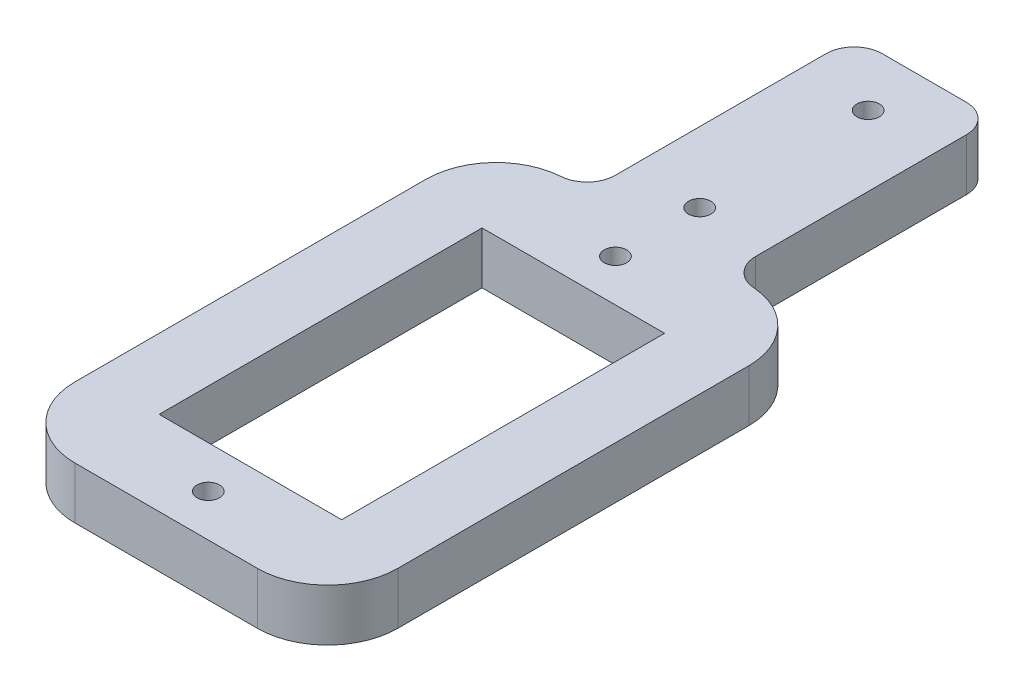
ISO-10303-21;
HEADER;
FILE_DESCRIPTION(('STEP AP214'),'2;1');
FILE_NAME('part.step','',(''),(''),'','','');
FILE_SCHEMA(('AUTOMOTIVE_DESIGN { 1 0 10303 214 1 1 1 1 }'));
ENDSEC;
DATA;
#1=APPLICATION_CONTEXT('core data for automotive mechanical design processes');
#2=APPLICATION_PROTOCOL_DEFINITION('international standard','automotive_design',2000,#1);
#3=PRODUCT_CONTEXT('',#1,'mechanical');
#4=PRODUCT('Part','Part','',(#3));
#5=PRODUCT_RELATED_PRODUCT_CATEGORY('part','',(#4));
#6=PRODUCT_DEFINITION_FORMATION('','',#4);
#7=PRODUCT_DEFINITION_CONTEXT('part definition',#1,'design');
#8=PRODUCT_DEFINITION('design','',#6,#7);
#9=PRODUCT_DEFINITION_SHAPE('','',#8);
#10=(LENGTH_UNIT() NAMED_UNIT(*) SI_UNIT(.MILLI.,.METRE.));
#11=(NAMED_UNIT(*) PLANE_ANGLE_UNIT() SI_UNIT($,.RADIAN.));
#12=(NAMED_UNIT(*) SI_UNIT($,.STERADIAN.) SOLID_ANGLE_UNIT());
#13=UNCERTAINTY_MEASURE_WITH_UNIT(LENGTH_MEASURE(1.E-05),#10,'distance_accuracy_value','');
#14=(GEOMETRIC_REPRESENTATION_CONTEXT(3) GLOBAL_UNCERTAINTY_ASSIGNED_CONTEXT((#13)) GLOBAL_UNIT_ASSIGNED_CONTEXT((#10,
#11,#12)) REPRESENTATION_CONTEXT('',''));
#15=CARTESIAN_POINT('',(0.,0.,0.));
#16=DIRECTION('',(0.,0.,1.));
#17=DIRECTION('',(1.,0.,0.));
#18=AXIS2_PLACEMENT_3D('',#15,#16,#17);
#19=CARTESIAN_POINT('',(11.5,-3.7,-17.5));
#20=DIRECTION('',(1.,0.,0.));
#21=DIRECTION('',(0.,0.,-1.));
#22=AXIS2_PLACEMENT_3D('',#19,#20,#21);
#23=PLANE('',#22);
#24=DIRECTION('',(0.,0.,-1.));
#25=VECTOR('',#24,1.);
#26=CARTESIAN_POINT('',(11.5,0.,-17.5));
#27=LINE('',#26,#25);
#28=CARTESIAN_POINT('',(11.5,0.,12.5));
#29=VERTEX_POINT('',#28);
#30=CARTESIAN_POINT('',(11.5,0.,-12.5));
#31=VERTEX_POINT('',#30);
#32=EDGE_CURVE('E204',#29,#31,#27,.T.);
#33=ORIENTED_EDGE('',*,*,#32,.F.);
#34=DIRECTION('',(0.,1.,0.));
#35=VECTOR('',#34,1.);
#36=CARTESIAN_POINT('',(11.5,-3.7,12.5));
#37=LINE('',#36,#35);
#38=CARTESIAN_POINT('',(11.5,-3.7,12.5));
#39=VERTEX_POINT('',#38);
#40=EDGE_CURVE('E242',#29,#39,#37,.F.);
#41=ORIENTED_EDGE('',*,*,#40,.T.);
#42=DIRECTION('',(0.,0.,-1.));
#43=VECTOR('',#42,1.);
#44=CARTESIAN_POINT('',(11.5,-3.7,-17.5));
#45=LINE('',#44,#43);
#46=CARTESIAN_POINT('',(11.5,-3.7,-12.5));
#47=VERTEX_POINT('',#46);
#48=EDGE_CURVE('E208',#39,#47,#45,.T.);
#49=ORIENTED_EDGE('',*,*,#48,.T.);
#50=DIRECTION('',(0.,1.,0.));
#51=VECTOR('',#50,1.);
#52=CARTESIAN_POINT('',(11.5,-3.7,-12.5));
#53=LINE('',#52,#51);
#54=EDGE_CURVE('E239',#47,#31,#53,.T.);
#55=ORIENTED_EDGE('',*,*,#54,.T.);
#56=EDGE_LOOP('',(#33,#41,#49,#55));
#57=FACE_BOUND('',#56,.T.);
#58=ADVANCED_FACE('F35',(#57),#23,.T.);
#59=CARTESIAN_POINT('',(11.5,-3.7,17.5));
#60=DIRECTION('',(0.,0.,1.));
#61=DIRECTION('',(1.,0.,0.));
#62=AXIS2_PLACEMENT_3D('',#59,#60,#61);
#63=PLANE('',#62);
#64=DIRECTION('',(1.,0.,0.));
#65=VECTOR('',#64,1.);
#66=CARTESIAN_POINT('',(11.5,-3.7,17.5));
#67=LINE('',#66,#65);
#68=CARTESIAN_POINT('',(-6.5,-3.7,17.5));
#69=VERTEX_POINT('',#68);
#70=CARTESIAN_POINT('',(6.5,-3.7,17.5));
#71=VERTEX_POINT('',#70);
#72=EDGE_CURVE('E215',#69,#71,#67,.T.);
#73=ORIENTED_EDGE('',*,*,#72,.T.);
#74=DIRECTION('',(0.,1.,0.));
#75=VECTOR('',#74,1.);
#76=CARTESIAN_POINT('',(6.5,-3.7,17.5));
#77=LINE('',#76,#75);
#78=CARTESIAN_POINT('',(6.5,0.,17.5));
#79=VERTEX_POINT('',#78);
#80=EDGE_CURVE('E227',#71,#79,#77,.T.);
#81=ORIENTED_EDGE('',*,*,#80,.T.);
#82=DIRECTION('',(1.,0.,0.));
#83=VECTOR('',#82,1.);
#84=CARTESIAN_POINT('',(11.5,0.,17.5));
#85=LINE('',#84,#83);
#86=CARTESIAN_POINT('',(-6.5,0.,17.5));
#87=VERTEX_POINT('',#86);
#88=EDGE_CURVE('E212',#87,#79,#85,.T.);
#89=ORIENTED_EDGE('',*,*,#88,.F.);
#90=DIRECTION('',(0.,1.,0.));
#91=VECTOR('',#90,1.);
#92=CARTESIAN_POINT('',(-6.5,-3.7,17.5));
#93=LINE('',#92,#91);
#94=EDGE_CURVE('E218',#87,#69,#93,.F.);
#95=ORIENTED_EDGE('',*,*,#94,.T.);
#96=EDGE_LOOP('',(#73,#81,#89,#95));
#97=FACE_BOUND('',#96,.T.);
#98=ADVANCED_FACE('F321',(#97),#63,.T.);
#99=CARTESIAN_POINT('',(-11.5,-3.7,17.5));
#100=DIRECTION('',(-1.,0.,0.));
#101=DIRECTION('',(0.,0.,1.));
#102=AXIS2_PLACEMENT_3D('',#99,#100,#101);
#103=PLANE('',#102);
#104=DIRECTION('',(0.,0.,1.));
#105=VECTOR('',#104,1.);
#106=CARTESIAN_POINT('',(-11.5,-3.7,17.5));
#107=LINE('',#106,#105);
#108=CARTESIAN_POINT('',(-11.5,-3.7,-12.5));
#109=VERTEX_POINT('',#108);
#110=CARTESIAN_POINT('',(-11.5,-3.7,12.5));
#111=VERTEX_POINT('',#110);
#112=EDGE_CURVE('E211',#109,#111,#107,.T.);
#113=ORIENTED_EDGE('',*,*,#112,.T.);
#114=DIRECTION('',(0.,1.,0.));
#115=VECTOR('',#114,1.);
#116=CARTESIAN_POINT('',(-11.5,-3.7,12.5));
#117=LINE('',#116,#115);
#118=CARTESIAN_POINT('',(-11.5,0.,12.5));
#119=VERTEX_POINT('',#118);
#120=EDGE_CURVE('E255',#111,#119,#117,.T.);
#121=ORIENTED_EDGE('',*,*,#120,.T.);
#122=DIRECTION('',(0.,0.,1.));
#123=VECTOR('',#122,1.);
#124=CARTESIAN_POINT('',(-11.5,0.,17.5));
#125=LINE('',#124,#123);
#126=CARTESIAN_POINT('',(-11.5,0.,-12.5));
#127=VERTEX_POINT('',#126);
#128=EDGE_CURVE('E221',#127,#119,#125,.T.);
#129=ORIENTED_EDGE('',*,*,#128,.F.);
#130=DIRECTION('',(0.,1.,0.));
#131=VECTOR('',#130,1.);
#132=CARTESIAN_POINT('',(-11.5,-3.7,-12.5));
#133=LINE('',#132,#131);
#134=EDGE_CURVE('E253',#127,#109,#133,.F.);
#135=ORIENTED_EDGE('',*,*,#134,.T.);
#136=EDGE_LOOP('',(#113,#121,#129,#135));
#137=FACE_BOUND('',#136,.T.);
#138=ADVANCED_FACE('F312',(#137),#103,.T.);
#139=CARTESIAN_POINT('',(0.,-3.7,0.));
#140=DIRECTION('',(0.,-1.,0.));
#141=DIRECTION('',(0.,0.,-1.));
#142=AXIS2_PLACEMENT_3D('',#139,#140,#141);
#143=PLANE('',#142);
#144=CARTESIAN_POINT('',(0.,-3.7,-32.5));
#145=DIRECTION('',(0.,1.,0.));
#146=DIRECTION('',(0.,0.,1.));
#147=AXIS2_PLACEMENT_3D('',#144,#145,#146);
#148=CIRCLE('',#147,0.800000000000001);
#149=CARTESIAN_POINT('',(0.,-3.7,-31.7));
#150=VERTEX_POINT('',#149);
#151=EDGE_CURVE('E418',#150,#150,#148,.T.);
#152=ORIENTED_EDGE('',*,*,#151,.T.);
#153=EDGE_LOOP('',(#152));
#154=FACE_BOUND('',#153,.T.);
#155=CARTESIAN_POINT('',(0.,-3.7,-20.5));
#156=DIRECTION('',(0.,1.,0.));
#157=DIRECTION('',(0.,0.,1.));
#158=AXIS2_PLACEMENT_3D('',#155,#156,#157);
#159=CIRCLE('',#158,0.799999999999998);
#160=CARTESIAN_POINT('',(0.,-3.7,-19.7));
#161=VERTEX_POINT('',#160);
#162=EDGE_CURVE('E427',#161,#161,#159,.T.);
#163=ORIENTED_EDGE('',*,*,#162,.T.);
#164=EDGE_LOOP('',(#163));
#165=FACE_BOUND('',#164,.T.);
#166=CARTESIAN_POINT('',(0.,-3.7,14.5));
#167=DIRECTION('',(0.,1.,0.));
#168=DIRECTION('',(0.,0.,1.));
#169=AXIS2_PLACEMENT_3D('',#166,#167,#168);
#170=CIRCLE('',#169,0.8);
#171=CARTESIAN_POINT('',(0.,-3.7,15.3));
#172=VERTEX_POINT('',#171);
#173=EDGE_CURVE('E352',#172,#172,#170,.T.);
#174=ORIENTED_EDGE('',*,*,#173,.T.);
#175=EDGE_LOOP('',(#174));
#176=FACE_BOUND('',#175,.T.);
#177=CARTESIAN_POINT('',(0.,-3.7,-14.5));
#178=DIRECTION('',(0.,1.,0.));
#179=DIRECTION('',(0.,0.,1.));
#180=AXIS2_PLACEMENT_3D('',#177,#178,#179);
#181=CIRCLE('',#180,0.8);
#182=CARTESIAN_POINT('',(0.,-3.7,-13.7));
#183=VERTEX_POINT('',#182);
#184=EDGE_CURVE('E198',#183,#183,#181,.T.);
#185=ORIENTED_EDGE('',*,*,#184,.T.);
#186=EDGE_LOOP('',(#185));
#187=FACE_BOUND('',#186,.T.);
#188=DIRECTION('',(-1.,0.,0.));
#189=VECTOR('',#188,1.);
#190=CARTESIAN_POINT('',(6.5,-3.7,-11.5));
#191=LINE('',#190,#189);
#192=CARTESIAN_POINT('',(6.5,-3.7,-11.5));
#193=VERTEX_POINT('',#192);
#194=CARTESIAN_POINT('',(-6.5,-3.7,-11.5));
#195=VERTEX_POINT('',#194);
#196=EDGE_CURVE('E165',#193,#195,#191,.T.);
#197=ORIENTED_EDGE('',*,*,#196,.T.);
#198=DIRECTION('',(0.,0.,1.));
#199=VECTOR('',#198,1.);
#200=CARTESIAN_POINT('',(-6.5,-3.7,-11.5));
#201=LINE('',#200,#199);
#202=CARTESIAN_POINT('',(-6.5,-3.7,11.5));
#203=VERTEX_POINT('',#202);
#204=EDGE_CURVE('E177',#195,#203,#201,.T.);
#205=ORIENTED_EDGE('',*,*,#204,.T.);
#206=DIRECTION('',(1.,0.,0.));
#207=VECTOR('',#206,1.);
#208=CARTESIAN_POINT('',(-6.5,-3.7,11.5));
#209=LINE('',#208,#207);
#210=CARTESIAN_POINT('',(6.5,-3.7,11.5));
#211=VERTEX_POINT('',#210);
#212=EDGE_CURVE('E181',#203,#211,#209,.T.);
#213=ORIENTED_EDGE('',*,*,#212,.T.);
#214=DIRECTION('',(0.,0.,-1.));
#215=VECTOR('',#214,1.);
#216=CARTESIAN_POINT('',(6.5,-3.7,11.5));
#217=LINE('',#216,#215);
#218=EDGE_CURVE('E173',#211,#193,#217,.T.);
#219=ORIENTED_EDGE('',*,*,#218,.T.);
#220=EDGE_LOOP('',(#197,#205,#213,#219));
#221=FACE_BOUND('',#220,.T.);
#222=DIRECTION('',(-1.,0.,0.));
#223=VECTOR('',#222,1.);
#224=CARTESIAN_POINT('',(5.,-3.7,-36.5));
#225=LINE('',#224,#223);
#226=CARTESIAN_POINT('',(3.,-3.7,-36.5));
#227=VERTEX_POINT('',#226);
#228=CARTESIAN_POINT('',(-3.,-3.7,-36.5));
#229=VERTEX_POINT('',#228);
#230=EDGE_CURVE('E351',#227,#229,#225,.T.);
#231=ORIENTED_EDGE('',*,*,#230,.F.);
#232=CARTESIAN_POINT('',(3.,-3.7,-34.5));
#233=DIRECTION('',(0.,-1.,0.));
#234=DIRECTION('',(0.,0.,-1.));
#235=AXIS2_PLACEMENT_3D('',#232,#233,#234);
#236=CIRCLE('',#235,2.);
#237=CARTESIAN_POINT('',(5.,-3.7,-34.5));
#238=VERTEX_POINT('',#237);
#239=EDGE_CURVE('E58',#227,#238,#236,.T.);
#240=ORIENTED_EDGE('',*,*,#239,.T.);
#241=DIRECTION('',(0.,0.,1.));
#242=VECTOR('',#241,1.);
#243=CARTESIAN_POINT('',(5.,-3.7,-36.5));
#244=LINE('',#243,#242);
#245=CARTESIAN_POINT('',(5.,-3.7,-19.4821200218845));
#246=VERTEX_POINT('',#245);
#247=EDGE_CURVE('E298',#238,#246,#244,.T.);
#248=ORIENTED_EDGE('',*,*,#247,.T.);
#249=CARTESIAN_POINT('',(7.,-3.7,-19.4821200218845));
#250=DIRECTION('',(0.,-1.,0.));
#251=DIRECTION('',(0.,0.,-1.));
#252=AXIS2_PLACEMENT_3D('',#249,#250,#251);
#253=CIRCLE('',#252,2.);
#254=CARTESIAN_POINT('',(6.85714285714286,-3.7,-17.4872285870603));
#255=VERTEX_POINT('',#254);
#256=EDGE_CURVE('E283',#246,#255,#253,.F.);
#257=ORIENTED_EDGE('',*,*,#256,.T.);
#258=CARTESIAN_POINT('',(6.5,-3.7,-12.5));
#259=DIRECTION('',(0.,-1.,0.));
#260=DIRECTION('',(0.,0.,-1.));
#261=AXIS2_PLACEMENT_3D('',#258,#259,#260);
#262=CIRCLE('',#261,5.);
#263=EDGE_CURVE('E247',#255,#47,#262,.T.);
#264=ORIENTED_EDGE('',*,*,#263,.T.);
#265=ORIENTED_EDGE('',*,*,#48,.F.);
#266=CARTESIAN_POINT('',(6.5,-3.7,12.5));
#267=DIRECTION('',(0.,-1.,0.));
#268=DIRECTION('',(0.,0.,-1.));
#269=AXIS2_PLACEMENT_3D('',#266,#267,#268);
#270=CIRCLE('',#269,5.);
#271=EDGE_CURVE('E251',#39,#71,#270,.T.);
#272=ORIENTED_EDGE('',*,*,#271,.T.);
#273=ORIENTED_EDGE('',*,*,#72,.F.);
#274=CARTESIAN_POINT('',(-6.5,-3.7,12.5));
#275=DIRECTION('',(0.,-1.,0.));
#276=DIRECTION('',(0.,0.,-1.));
#277=AXIS2_PLACEMENT_3D('',#274,#275,#276);
#278=CIRCLE('',#277,5.);
#279=EDGE_CURVE('E249',#69,#111,#278,.T.);
#280=ORIENTED_EDGE('',*,*,#279,.T.);
#281=ORIENTED_EDGE('',*,*,#112,.F.);
#282=CARTESIAN_POINT('',(-6.5,-3.7,-12.5));
#283=DIRECTION('',(0.,-1.,0.));
#284=DIRECTION('',(0.,0.,-1.));
#285=AXIS2_PLACEMENT_3D('',#282,#283,#284);
#286=CIRCLE('',#285,5.);
#287=CARTESIAN_POINT('',(-6.85714285714286,-3.7,-17.4872285870603));
#288=VERTEX_POINT('',#287);
#289=EDGE_CURVE('E244',#109,#288,#286,.T.);
#290=ORIENTED_EDGE('',*,*,#289,.T.);
#291=CARTESIAN_POINT('',(-7.,-3.7,-19.4821200218845));
#292=DIRECTION('',(0.,-1.,0.));
#293=DIRECTION('',(0.,0.,-1.));
#294=AXIS2_PLACEMENT_3D('',#291,#292,#293);
#295=CIRCLE('',#294,2.);
#296=CARTESIAN_POINT('',(-5.,-3.7,-19.4821200218845));
#297=VERTEX_POINT('',#296);
#298=EDGE_CURVE('E43',#288,#297,#295,.F.);
#299=ORIENTED_EDGE('',*,*,#298,.T.);
#300=DIRECTION('',(0.,0.,1.));
#301=VECTOR('',#300,1.);
#302=CARTESIAN_POINT('',(-5.,-3.7,-36.5));
#303=LINE('',#302,#301);
#304=CARTESIAN_POINT('',(-5.,-3.7,-34.5));
#305=VERTEX_POINT('',#304);
#306=EDGE_CURVE('E287',#305,#297,#303,.T.);
#307=ORIENTED_EDGE('',*,*,#306,.F.);
#308=CARTESIAN_POINT('',(-3.,-3.7,-34.5));
#309=DIRECTION('',(0.,-1.,0.));
#310=DIRECTION('',(0.,0.,-1.));
#311=AXIS2_PLACEMENT_3D('',#308,#309,#310);
#312=CIRCLE('',#311,2.);
#313=EDGE_CURVE('E50',#305,#229,#312,.T.);
#314=ORIENTED_EDGE('',*,*,#313,.T.);
#315=EDGE_LOOP('',(#231,#240,#248,#257,#264,#265,#272,#273,#280,#281,#290,#299,#307,#314));
#316=FACE_BOUND('',#315,.T.);
#317=ADVANCED_FACE('F183',(#154,#165,#176,#187,#221,#316),#143,.T.);
#318=CARTESIAN_POINT('',(0.,0.,0.));
#319=DIRECTION('',(0.,-1.,0.));
#320=DIRECTION('',(0.,0.,-1.));
#321=AXIS2_PLACEMENT_3D('',#318,#319,#320);
#322=PLANE('',#321);
#323=CARTESIAN_POINT('',(0.,0.,-32.5));
#324=DIRECTION('',(0.,1.,0.));
#325=DIRECTION('',(0.,0.,1.));
#326=AXIS2_PLACEMENT_3D('',#323,#324,#325);
#327=CIRCLE('',#326,0.800000000000001);
#328=CARTESIAN_POINT('',(0.,0.,-31.7));
#329=VERTEX_POINT('',#328);
#330=EDGE_CURVE('E421',#329,#329,#327,.T.);
#331=ORIENTED_EDGE('',*,*,#330,.F.);
#332=EDGE_LOOP('',(#331));
#333=FACE_BOUND('',#332,.T.);
#334=CARTESIAN_POINT('',(0.,0.,-20.5));
#335=DIRECTION('',(0.,1.,0.));
#336=DIRECTION('',(0.,0.,1.));
#337=AXIS2_PLACEMENT_3D('',#334,#335,#336);
#338=CIRCLE('',#337,0.799999999999998);
#339=CARTESIAN_POINT('',(0.,0.,-19.7));
#340=VERTEX_POINT('',#339);
#341=EDGE_CURVE('E424',#340,#340,#338,.T.);
#342=ORIENTED_EDGE('',*,*,#341,.F.);
#343=EDGE_LOOP('',(#342));
#344=FACE_BOUND('',#343,.T.);
#345=CARTESIAN_POINT('',(0.,0.,14.5));
#346=DIRECTION('',(0.,1.,0.));
#347=DIRECTION('',(0.,0.,1.));
#348=AXIS2_PLACEMENT_3D('',#345,#346,#347);
#349=CIRCLE('',#348,0.8);
#350=CARTESIAN_POINT('',(0.,0.,15.3));
#351=VERTEX_POINT('',#350);
#352=EDGE_CURVE('E346',#351,#351,#349,.T.);
#353=ORIENTED_EDGE('',*,*,#352,.F.);
#354=EDGE_LOOP('',(#353));
#355=FACE_BOUND('',#354,.T.);
#356=CARTESIAN_POINT('',(0.,0.,-14.5));
#357=DIRECTION('',(0.,1.,0.));
#358=DIRECTION('',(0.,0.,1.));
#359=AXIS2_PLACEMENT_3D('',#356,#357,#358);
#360=CIRCLE('',#359,0.8);
#361=CARTESIAN_POINT('',(0.,0.,-13.7));
#362=VERTEX_POINT('',#361);
#363=EDGE_CURVE('E191',#362,#362,#360,.T.);
#364=ORIENTED_EDGE('',*,*,#363,.F.);
#365=EDGE_LOOP('',(#364));
#366=FACE_BOUND('',#365,.T.);
#367=DIRECTION('',(0.,0.,1.));
#368=VECTOR('',#367,1.);
#369=CARTESIAN_POINT('',(-6.5,0.,-11.5));
#370=LINE('',#369,#368);
#371=CARTESIAN_POINT('',(-6.5,0.,-11.5));
#372=VERTEX_POINT('',#371);
#373=CARTESIAN_POINT('',(-6.5,0.,11.5));
#374=VERTEX_POINT('',#373);
#375=EDGE_CURVE('E197',#372,#374,#370,.T.);
#376=ORIENTED_EDGE('',*,*,#375,.F.);
#377=DIRECTION('',(-1.,0.,0.));
#378=VECTOR('',#377,1.);
#379=CARTESIAN_POINT('',(6.5,0.,-11.5));
#380=LINE('',#379,#378);
#381=CARTESIAN_POINT('',(6.5,0.,-11.5));
#382=VERTEX_POINT('',#381);
#383=EDGE_CURVE('E168',#382,#372,#380,.T.);
#384=ORIENTED_EDGE('',*,*,#383,.F.);
#385=DIRECTION('',(0.,0.,-1.));
#386=VECTOR('',#385,1.);
#387=CARTESIAN_POINT('',(6.5,0.,11.5));
#388=LINE('',#387,#386);
#389=CARTESIAN_POINT('',(6.5,0.,11.5));
#390=VERTEX_POINT('',#389);
#391=EDGE_CURVE('E185',#390,#382,#388,.T.);
#392=ORIENTED_EDGE('',*,*,#391,.F.);
#393=DIRECTION('',(1.,0.,0.));
#394=VECTOR('',#393,1.);
#395=CARTESIAN_POINT('',(-6.5,0.,11.5));
#396=LINE('',#395,#394);
#397=EDGE_CURVE('E188',#374,#390,#396,.T.);
#398=ORIENTED_EDGE('',*,*,#397,.F.);
#399=EDGE_LOOP('',(#376,#384,#392,#398));
#400=FACE_BOUND('',#399,.T.);
#401=DIRECTION('',(0.,0.,1.));
#402=VECTOR('',#401,1.);
#403=CARTESIAN_POINT('',(5.,0.,-36.5));
#404=LINE('',#403,#402);
#405=CARTESIAN_POINT('',(5.,0.,-34.5));
#406=VERTEX_POINT('',#405);
#407=CARTESIAN_POINT('',(5.,0.,-19.4821200218845));
#408=VERTEX_POINT('',#407);
#409=EDGE_CURVE('E344',#406,#408,#404,.T.);
#410=ORIENTED_EDGE('',*,*,#409,.F.);
#411=CARTESIAN_POINT('',(3.,0.,-34.5));
#412=DIRECTION('',(0.,-1.,0.));
#413=DIRECTION('',(0.,0.,-1.));
#414=AXIS2_PLACEMENT_3D('',#411,#412,#413);
#415=CIRCLE('',#414,2.);
#416=CARTESIAN_POINT('',(3.,0.,-36.5));
#417=VERTEX_POINT('',#416);
#418=EDGE_CURVE('E281',#406,#417,#415,.F.);
#419=ORIENTED_EDGE('',*,*,#418,.T.);
#420=DIRECTION('',(-1.,0.,0.));
#421=VECTOR('',#420,1.);
#422=CARTESIAN_POINT('',(5.,0.,-36.5));
#423=LINE('',#422,#421);
#424=CARTESIAN_POINT('',(-3.,0.,-36.5));
#425=VERTEX_POINT('',#424);
#426=EDGE_CURVE('E413',#417,#425,#423,.T.);
#427=ORIENTED_EDGE('',*,*,#426,.T.);
#428=CARTESIAN_POINT('',(-3.,0.,-34.5));
#429=DIRECTION('',(0.,-1.,0.));
#430=DIRECTION('',(0.,0.,-1.));
#431=AXIS2_PLACEMENT_3D('',#428,#429,#430);
#432=CIRCLE('',#431,2.);
#433=CARTESIAN_POINT('',(-5.,0.,-34.5));
#434=VERTEX_POINT('',#433);
#435=EDGE_CURVE('E279',#425,#434,#432,.F.);
#436=ORIENTED_EDGE('',*,*,#435,.T.);
#437=DIRECTION('',(0.,0.,1.));
#438=VECTOR('',#437,1.);
#439=CARTESIAN_POINT('',(-5.,0.,-36.5));
#440=LINE('',#439,#438);
#441=CARTESIAN_POINT('',(-5.,0.,-19.4821200218845));
#442=VERTEX_POINT('',#441);
#443=EDGE_CURVE('E299',#434,#442,#440,.T.);
#444=ORIENTED_EDGE('',*,*,#443,.T.);
#445=CARTESIAN_POINT('',(-7.,0.,-19.4821200218845));
#446=DIRECTION('',(0.,-1.,0.));
#447=DIRECTION('',(0.,0.,-1.));
#448=AXIS2_PLACEMENT_3D('',#445,#446,#447);
#449=CIRCLE('',#448,2.);
#450=CARTESIAN_POINT('',(-6.85714285714286,0.,-17.4872285870603));
#451=VERTEX_POINT('',#450);
#452=EDGE_CURVE('E11',#442,#451,#449,.T.);
#453=ORIENTED_EDGE('',*,*,#452,.T.);
#454=CARTESIAN_POINT('',(-6.5,0.,-12.5));
#455=DIRECTION('',(0.,-1.,0.));
#456=DIRECTION('',(0.,0.,-1.));
#457=AXIS2_PLACEMENT_3D('',#454,#455,#456);
#458=CIRCLE('',#457,5.);
#459=EDGE_CURVE('E230',#451,#127,#458,.F.);
#460=ORIENTED_EDGE('',*,*,#459,.T.);
#461=ORIENTED_EDGE('',*,*,#128,.T.);
#462=CARTESIAN_POINT('',(-6.5,0.,12.5));
#463=DIRECTION('',(0.,-1.,0.));
#464=DIRECTION('',(0.,0.,-1.));
#465=AXIS2_PLACEMENT_3D('',#462,#463,#464);
#466=CIRCLE('',#465,5.);
#467=EDGE_CURVE('E235',#119,#87,#466,.F.);
#468=ORIENTED_EDGE('',*,*,#467,.T.);
#469=ORIENTED_EDGE('',*,*,#88,.T.);
#470=CARTESIAN_POINT('',(6.5,0.,12.5));
#471=DIRECTION('',(0.,-1.,0.));
#472=DIRECTION('',(0.,0.,-1.));
#473=AXIS2_PLACEMENT_3D('',#470,#471,#472);
#474=CIRCLE('',#473,5.);
#475=EDGE_CURVE('E237',#79,#29,#474,.F.);
#476=ORIENTED_EDGE('',*,*,#475,.T.);
#477=ORIENTED_EDGE('',*,*,#32,.T.);
#478=CARTESIAN_POINT('',(6.5,0.,-12.5));
#479=DIRECTION('',(0.,-1.,0.));
#480=DIRECTION('',(0.,0.,-1.));
#481=AXIS2_PLACEMENT_3D('',#478,#479,#480);
#482=CIRCLE('',#481,5.);
#483=CARTESIAN_POINT('',(6.85714285714286,0.,-17.4872285870603));
#484=VERTEX_POINT('',#483);
#485=EDGE_CURVE('E232',#31,#484,#482,.F.);
#486=ORIENTED_EDGE('',*,*,#485,.T.);
#487=CARTESIAN_POINT('',(7.,0.,-19.4821200218845));
#488=DIRECTION('',(0.,-1.,0.));
#489=DIRECTION('',(0.,0.,-1.));
#490=AXIS2_PLACEMENT_3D('',#487,#488,#489);
#491=CIRCLE('',#490,2.);
#492=EDGE_CURVE('E285',#484,#408,#491,.T.);
#493=ORIENTED_EDGE('',*,*,#492,.T.);
#494=EDGE_LOOP('',(#410,#419,#427,#436,#444,#453,#460,#461,#468,#469,#476,#477,#486,#493));
#495=FACE_BOUND('',#494,.T.);
#496=ADVANCED_FACE('F306',(#333,#344,#355,#366,#400,#495),#322,.F.);
#497=CARTESIAN_POINT('',(6.5,-3.7,-11.5));
#498=DIRECTION('',(0.,0.,-1.));
#499=DIRECTION('',(-1.,0.,0.));
#500=AXIS2_PLACEMENT_3D('',#497,#498,#499);
#501=PLANE('',#500);
#502=ORIENTED_EDGE('',*,*,#383,.T.);
#503=DIRECTION('',(0.,1.,0.));
#504=VECTOR('',#503,1.);
#505=CARTESIAN_POINT('',(-6.5,-3.7,-11.5));
#506=LINE('',#505,#504);
#507=EDGE_CURVE('E161',#195,#372,#506,.T.);
#508=ORIENTED_EDGE('',*,*,#507,.F.);
#509=ORIENTED_EDGE('',*,*,#196,.F.);
#510=DIRECTION('',(0.,1.,0.));
#511=VECTOR('',#510,1.);
#512=CARTESIAN_POINT('',(6.5,-3.7,-11.5));
#513=LINE('',#512,#511);
#514=EDGE_CURVE('E202',#193,#382,#513,.T.);
#515=ORIENTED_EDGE('',*,*,#514,.T.);
#516=EDGE_LOOP('',(#502,#508,#509,#515));
#517=FACE_BOUND('',#516,.T.);
#518=ADVANCED_FACE('F163',(#517),#501,.F.);
#519=CARTESIAN_POINT('',(6.5,-3.7,11.5));
#520=DIRECTION('',(1.,0.,0.));
#521=DIRECTION('',(0.,0.,-1.));
#522=AXIS2_PLACEMENT_3D('',#519,#520,#521);
#523=PLANE('',#522);
#524=ORIENTED_EDGE('',*,*,#391,.T.);
#525=ORIENTED_EDGE('',*,*,#514,.F.);
#526=ORIENTED_EDGE('',*,*,#218,.F.);
#527=DIRECTION('',(0.,1.,0.));
#528=VECTOR('',#527,1.);
#529=CARTESIAN_POINT('',(6.5,-3.7,11.5));
#530=LINE('',#529,#528);
#531=EDGE_CURVE('E205',#211,#390,#530,.T.);
#532=ORIENTED_EDGE('',*,*,#531,.T.);
#533=EDGE_LOOP('',(#524,#525,#526,#532));
#534=FACE_BOUND('',#533,.T.);
#535=ADVANCED_FACE('F373',(#534),#523,.F.);
#536=CARTESIAN_POINT('',(-6.5,-3.7,11.5));
#537=DIRECTION('',(0.,0.,1.));
#538=DIRECTION('',(1.,0.,0.));
#539=AXIS2_PLACEMENT_3D('',#536,#537,#538);
#540=PLANE('',#539);
#541=ORIENTED_EDGE('',*,*,#397,.T.);
#542=ORIENTED_EDGE('',*,*,#531,.F.);
#543=ORIENTED_EDGE('',*,*,#212,.F.);
#544=DIRECTION('',(0.,1.,0.));
#545=VECTOR('',#544,1.);
#546=CARTESIAN_POINT('',(-6.5,-3.7,11.5));
#547=LINE('',#546,#545);
#548=EDGE_CURVE('E172',#203,#374,#547,.T.);
#549=ORIENTED_EDGE('',*,*,#548,.T.);
#550=EDGE_LOOP('',(#541,#542,#543,#549));
#551=FACE_BOUND('',#550,.T.);
#552=ADVANCED_FACE('F371',(#551),#540,.F.);
#553=CARTESIAN_POINT('',(-6.5,-3.7,-11.5));
#554=DIRECTION('',(-1.,0.,0.));
#555=DIRECTION('',(0.,0.,1.));
#556=AXIS2_PLACEMENT_3D('',#553,#554,#555);
#557=PLANE('',#556);
#558=ORIENTED_EDGE('',*,*,#375,.T.);
#559=ORIENTED_EDGE('',*,*,#548,.F.);
#560=ORIENTED_EDGE('',*,*,#204,.F.);
#561=ORIENTED_EDGE('',*,*,#507,.T.);
#562=EDGE_LOOP('',(#558,#559,#560,#561));
#563=FACE_BOUND('',#562,.T.);
#564=ADVANCED_FACE('F178',(#563),#557,.F.);
#565=CARTESIAN_POINT('',(0.,-3.7,-14.5));
#566=DIRECTION('',(0.,1.,0.));
#567=DIRECTION('',(0.,0.,1.));
#568=AXIS2_PLACEMENT_3D('',#565,#566,#567);
#569=CYLINDRICAL_SURFACE('',#568,0.8);
#570=ORIENTED_EDGE('',*,*,#184,.F.);
#571=EDGE_LOOP('',(#570));
#572=FACE_BOUND('',#571,.T.);
#573=ORIENTED_EDGE('',*,*,#363,.T.);
#574=EDGE_LOOP('',(#573));
#575=FACE_BOUND('',#574,.T.);
#576=ADVANCED_FACE('F362',(#572,#575),#569,.F.);
#577=CARTESIAN_POINT('',(0.,-3.7,14.5));
#578=DIRECTION('',(0.,1.,0.));
#579=DIRECTION('',(0.,0.,1.));
#580=AXIS2_PLACEMENT_3D('',#577,#578,#579);
#581=CYLINDRICAL_SURFACE('',#580,0.8);
#582=ORIENTED_EDGE('',*,*,#173,.F.);
#583=EDGE_LOOP('',(#582));
#584=FACE_BOUND('',#583,.T.);
#585=ORIENTED_EDGE('',*,*,#352,.T.);
#586=EDGE_LOOP('',(#585));
#587=FACE_BOUND('',#586,.T.);
#588=ADVANCED_FACE('F438',(#584,#587),#581,.F.);
#589=CARTESIAN_POINT('',(5.,0.,-36.5));
#590=DIRECTION('',(-1.,0.,0.));
#591=DIRECTION('',(0.,0.,1.));
#592=AXIS2_PLACEMENT_3D('',#589,#590,#591);
#593=PLANE('',#592);
#594=ORIENTED_EDGE('',*,*,#409,.T.);
#595=DIRECTION('',(0.,1.,0.));
#596=VECTOR('',#595,1.);
#597=CARTESIAN_POINT('',(5.,0.,-19.4821200218845));
#598=LINE('',#597,#596);
#599=EDGE_CURVE('E260',#408,#246,#598,.F.);
#600=ORIENTED_EDGE('',*,*,#599,.T.);
#601=ORIENTED_EDGE('',*,*,#247,.F.);
#602=DIRECTION('',(0.,-1.,0.));
#603=VECTOR('',#602,1.);
#604=CARTESIAN_POINT('',(5.,0.,-34.5));
#605=LINE('',#604,#603);
#606=EDGE_CURVE('E258',#238,#406,#605,.F.);
#607=ORIENTED_EDGE('',*,*,#606,.T.);
#608=EDGE_LOOP('',(#594,#600,#601,#607));
#609=FACE_BOUND('',#608,.T.);
#610=ADVANCED_FACE('F343',(#609),#593,.F.);
#611=CARTESIAN_POINT('',(-5.,0.,-36.5));
#612=DIRECTION('',(-1.,0.,0.));
#613=DIRECTION('',(0.,0.,1.));
#614=AXIS2_PLACEMENT_3D('',#611,#612,#613);
#615=PLANE('',#614);
#616=ORIENTED_EDGE('',*,*,#306,.T.);
#617=DIRECTION('',(0.,-1.,0.));
#618=VECTOR('',#617,1.);
#619=CARTESIAN_POINT('',(-5.,0.,-19.4821200218845));
#620=LINE('',#619,#618);
#621=EDGE_CURVE('E271',#297,#442,#620,.F.);
#622=ORIENTED_EDGE('',*,*,#621,.T.);
#623=ORIENTED_EDGE('',*,*,#443,.F.);
#624=DIRECTION('',(0.,-1.,0.));
#625=VECTOR('',#624,1.);
#626=CARTESIAN_POINT('',(-5.,-3.7,-34.5));
#627=LINE('',#626,#625);
#628=EDGE_CURVE('E268',#434,#305,#627,.T.);
#629=ORIENTED_EDGE('',*,*,#628,.T.);
#630=EDGE_LOOP('',(#616,#622,#623,#629));
#631=FACE_BOUND('',#630,.T.);
#632=ADVANCED_FACE('F294',(#631),#615,.T.);
#633=CARTESIAN_POINT('',(0.,0.,-36.5));
#634=DIRECTION('',(0.,0.,1.));
#635=DIRECTION('',(1.,0.,0.));
#636=AXIS2_PLACEMENT_3D('',#633,#634,#635);
#637=PLANE('',#636);
#638=ORIENTED_EDGE('',*,*,#426,.F.);
#639=DIRECTION('',(0.,-1.,0.));
#640=VECTOR('',#639,1.);
#641=CARTESIAN_POINT('',(3.,0.,-36.5));
#642=LINE('',#641,#640);
#643=EDGE_CURVE('E275',#417,#227,#642,.T.);
#644=ORIENTED_EDGE('',*,*,#643,.T.);
#645=ORIENTED_EDGE('',*,*,#230,.T.);
#646=DIRECTION('',(0.,-1.,0.));
#647=VECTOR('',#646,1.);
#648=CARTESIAN_POINT('',(-3.,0.,-36.5));
#649=LINE('',#648,#647);
#650=EDGE_CURVE('E273',#229,#425,#649,.F.);
#651=ORIENTED_EDGE('',*,*,#650,.T.);
#652=EDGE_LOOP('',(#638,#644,#645,#651));
#653=FACE_BOUND('',#652,.T.);
#654=ADVANCED_FACE('F416',(#653),#637,.F.);
#655=CARTESIAN_POINT('',(0.,-3.7,-20.5));
#656=DIRECTION('',(0.,1.,0.));
#657=DIRECTION('',(0.,0.,1.));
#658=AXIS2_PLACEMENT_3D('',#655,#656,#657);
#659=CYLINDRICAL_SURFACE('',#658,0.799999999999998);
#660=ORIENTED_EDGE('',*,*,#162,.F.);
#661=EDGE_LOOP('',(#660));
#662=FACE_BOUND('',#661,.T.);
#663=ORIENTED_EDGE('',*,*,#341,.T.);
#664=EDGE_LOOP('',(#663));
#665=FACE_BOUND('',#664,.T.);
#666=ADVANCED_FACE('F455',(#662,#665),#659,.F.);
#667=CARTESIAN_POINT('',(0.,-3.7,-32.5));
#668=DIRECTION('',(0.,1.,0.));
#669=DIRECTION('',(0.,0.,1.));
#670=AXIS2_PLACEMENT_3D('',#667,#668,#669);
#671=CYLINDRICAL_SURFACE('',#670,0.800000000000001);
#672=ORIENTED_EDGE('',*,*,#151,.F.);
#673=EDGE_LOOP('',(#672));
#674=FACE_BOUND('',#673,.T.);
#675=ORIENTED_EDGE('',*,*,#330,.T.);
#676=EDGE_LOOP('',(#675));
#677=FACE_BOUND('',#676,.T.);
#678=ADVANCED_FACE('F394',(#674,#677),#671,.F.);
#679=CARTESIAN_POINT('',(6.5,-3.7,12.5));
#680=DIRECTION('',(0.,1.,0.));
#681=DIRECTION('',(0.,0.,1.));
#682=AXIS2_PLACEMENT_3D('',#679,#680,#681);
#683=CYLINDRICAL_SURFACE('',#682,5.);
#684=ORIENTED_EDGE('',*,*,#271,.F.);
#685=ORIENTED_EDGE('',*,*,#40,.F.);
#686=ORIENTED_EDGE('',*,*,#475,.F.);
#687=ORIENTED_EDGE('',*,*,#80,.F.);
#688=EDGE_LOOP('',(#684,#685,#686,#687));
#689=FACE_BOUND('',#688,.T.);
#690=ADVANCED_FACE('F325',(#689),#683,.T.);
#691=CARTESIAN_POINT('',(-6.5,-3.7,12.5));
#692=DIRECTION('',(0.,1.,0.));
#693=DIRECTION('',(0.,0.,1.));
#694=AXIS2_PLACEMENT_3D('',#691,#692,#693);
#695=CYLINDRICAL_SURFACE('',#694,5.);
#696=ORIENTED_EDGE('',*,*,#279,.F.);
#697=ORIENTED_EDGE('',*,*,#94,.F.);
#698=ORIENTED_EDGE('',*,*,#467,.F.);
#699=ORIENTED_EDGE('',*,*,#120,.F.);
#700=EDGE_LOOP('',(#696,#697,#698,#699));
#701=FACE_BOUND('',#700,.T.);
#702=ADVANCED_FACE('F318',(#701),#695,.T.);
#703=CARTESIAN_POINT('',(6.5,-3.7,-12.5));
#704=DIRECTION('',(0.,1.,0.));
#705=DIRECTION('',(0.,0.,1.));
#706=AXIS2_PLACEMENT_3D('',#703,#704,#705);
#707=CYLINDRICAL_SURFACE('',#706,5.);
#708=ORIENTED_EDGE('',*,*,#263,.F.);
#709=DIRECTION('',(0.,1.,0.));
#710=VECTOR('',#709,1.);
#711=CARTESIAN_POINT('',(6.85714285714286,-3.7,-17.4872285870603));
#712=LINE('',#711,#710);
#713=EDGE_CURVE('E263',#255,#484,#712,.T.);
#714=ORIENTED_EDGE('',*,*,#713,.T.);
#715=ORIENTED_EDGE('',*,*,#485,.F.);
#716=ORIENTED_EDGE('',*,*,#54,.F.);
#717=EDGE_LOOP('',(#708,#714,#715,#716));
#718=FACE_BOUND('',#717,.T.);
#719=ADVANCED_FACE('F333',(#718),#707,.T.);
#720=CARTESIAN_POINT('',(-6.5,-3.7,-12.5));
#721=DIRECTION('',(0.,1.,0.));
#722=DIRECTION('',(0.,0.,1.));
#723=AXIS2_PLACEMENT_3D('',#720,#721,#722);
#724=CYLINDRICAL_SURFACE('',#723,5.);
#725=ORIENTED_EDGE('',*,*,#459,.F.);
#726=DIRECTION('',(0.,1.,0.));
#727=VECTOR('',#726,1.);
#728=CARTESIAN_POINT('',(-6.85714285714286,-3.7,-17.4872285870603));
#729=LINE('',#728,#727);
#730=EDGE_CURVE('E265',#451,#288,#729,.F.);
#731=ORIENTED_EDGE('',*,*,#730,.T.);
#732=ORIENTED_EDGE('',*,*,#289,.F.);
#733=ORIENTED_EDGE('',*,*,#134,.F.);
#734=EDGE_LOOP('',(#725,#731,#732,#733));
#735=FACE_BOUND('',#734,.T.);
#736=ADVANCED_FACE('F310',(#735),#724,.T.);
#737=CARTESIAN_POINT('',(7.,-3.7,-19.4821200218845));
#738=DIRECTION('',(0.,1.,0.));
#739=DIRECTION('',(0.,0.,1.));
#740=AXIS2_PLACEMENT_3D('',#737,#738,#739);
#741=CYLINDRICAL_SURFACE('',#740,2.);
#742=ORIENTED_EDGE('',*,*,#492,.F.);
#743=ORIENTED_EDGE('',*,*,#713,.F.);
#744=ORIENTED_EDGE('',*,*,#256,.F.);
#745=ORIENTED_EDGE('',*,*,#599,.F.);
#746=EDGE_LOOP('',(#742,#743,#744,#745));
#747=FACE_BOUND('',#746,.T.);
#748=ADVANCED_FACE('F339',(#747),#741,.F.);
#749=CARTESIAN_POINT('',(-7.,-3.7,-19.4821200218845));
#750=DIRECTION('',(0.,1.,0.));
#751=DIRECTION('',(0.,0.,1.));
#752=AXIS2_PLACEMENT_3D('',#749,#750,#751);
#753=CYLINDRICAL_SURFACE('',#752,2.);
#754=ORIENTED_EDGE('',*,*,#452,.F.);
#755=ORIENTED_EDGE('',*,*,#621,.F.);
#756=ORIENTED_EDGE('',*,*,#298,.F.);
#757=ORIENTED_EDGE('',*,*,#730,.F.);
#758=EDGE_LOOP('',(#754,#755,#756,#757));
#759=FACE_BOUND('',#758,.T.);
#760=ADVANCED_FACE('F302',(#759),#753,.F.);
#761=CARTESIAN_POINT('',(3.,0.,-34.5));
#762=DIRECTION('',(0.,-1.,0.));
#763=DIRECTION('',(0.,0.,-1.));
#764=AXIS2_PLACEMENT_3D('',#761,#762,#763);
#765=CYLINDRICAL_SURFACE('',#764,2.);
#766=ORIENTED_EDGE('',*,*,#418,.F.);
#767=ORIENTED_EDGE('',*,*,#606,.F.);
#768=ORIENTED_EDGE('',*,*,#239,.F.);
#769=ORIENTED_EDGE('',*,*,#643,.F.);
#770=EDGE_LOOP('',(#766,#767,#768,#769));
#771=FACE_BOUND('',#770,.T.);
#772=ADVANCED_FACE('F404',(#771),#765,.T.);
#773=CARTESIAN_POINT('',(-3.,0.,-34.5));
#774=DIRECTION('',(0.,1.,0.));
#775=DIRECTION('',(0.,0.,1.));
#776=AXIS2_PLACEMENT_3D('',#773,#774,#775);
#777=CYLINDRICAL_SURFACE('',#776,2.);
#778=ORIENTED_EDGE('',*,*,#435,.F.);
#779=ORIENTED_EDGE('',*,*,#650,.F.);
#780=ORIENTED_EDGE('',*,*,#313,.F.);
#781=ORIENTED_EDGE('',*,*,#628,.F.);
#782=EDGE_LOOP('',(#778,#779,#780,#781));
#783=FACE_BOUND('',#782,.T.);
#784=ADVANCED_FACE('F37',(#783),#777,.T.);
#785=CLOSED_SHELL('',(#58,#98,#138,#317,#496,#518,#535,#552,#564,#576,#588,#610,#632,#654,#666,
#678,#690,#702,#719,#736,#748,#760,#772,#784));
#786=MANIFOLD_SOLID_BREP('B2',#785);
#787=ADVANCED_BREP_SHAPE_REPRESENTATION('',(#18,#786),#14);
#788=SHAPE_DEFINITION_REPRESENTATION(#9,#787);
ENDSEC;
END-ISO-10303-21;
